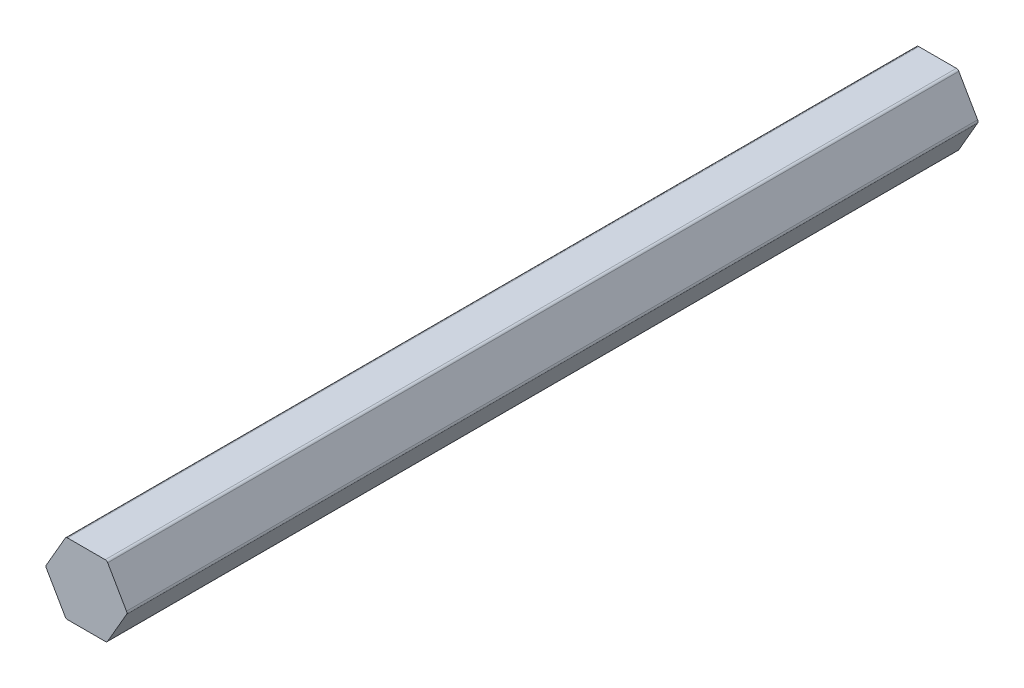
ISO-10303-21;
HEADER;
FILE_DESCRIPTION(('STEP AP214'),'2;1');
FILE_NAME('part.step','',(''),(''),'','','');
FILE_SCHEMA(('AUTOMOTIVE_DESIGN { 1 0 10303 214 1 1 1 1 }'));
ENDSEC;
DATA;
#1=APPLICATION_CONTEXT('core data for automotive mechanical design processes');
#2=APPLICATION_PROTOCOL_DEFINITION('international standard','automotive_design',2000,#1);
#3=PRODUCT_CONTEXT('',#1,'mechanical');
#4=PRODUCT('Part','Part','',(#3));
#5=PRODUCT_RELATED_PRODUCT_CATEGORY('part','',(#4));
#6=PRODUCT_DEFINITION_FORMATION('','',#4);
#7=PRODUCT_DEFINITION_CONTEXT('part definition',#1,'design');
#8=PRODUCT_DEFINITION('design','',#6,#7);
#9=PRODUCT_DEFINITION_SHAPE('','',#8);
#10=(LENGTH_UNIT() NAMED_UNIT(*) SI_UNIT(.MILLI.,.METRE.));
#11=(NAMED_UNIT(*) PLANE_ANGLE_UNIT() SI_UNIT($,.RADIAN.));
#12=(NAMED_UNIT(*) SI_UNIT($,.STERADIAN.) SOLID_ANGLE_UNIT());
#13=UNCERTAINTY_MEASURE_WITH_UNIT(LENGTH_MEASURE(1.E-05),#10,'distance_accuracy_value','');
#14=(GEOMETRIC_REPRESENTATION_CONTEXT(3) GLOBAL_UNCERTAINTY_ASSIGNED_CONTEXT((#13)) GLOBAL_UNIT_ASSIGNED_CONTEXT((#10,
#11,#12)) REPRESENTATION_CONTEXT('',''));
#15=CARTESIAN_POINT('',(0.,0.,0.));
#16=DIRECTION('',(0.,0.,1.));
#17=DIRECTION('',(1.,0.,0.));
#18=AXIS2_PLACEMENT_3D('',#15,#16,#17);
#19=CARTESIAN_POINT('',(3.36554792418709,5.8293,457.2));
#20=DIRECTION('',(0.,0.,-1.));
#21=DIRECTION('',(-1.,0.,0.));
#22=AXIS2_PLACEMENT_3D('',#19,#20,#21);
#23=CYLINDRICAL_SURFACE('',#22,0.508);
#24=CARTESIAN_POINT('',(3.36554792418709,5.8293,304.8));
#25=DIRECTION('',(0.,0.,1.));
#26=DIRECTION('',(1.,0.,0.));
#27=AXIS2_PLACEMENT_3D('',#24,#25,#26);
#28=CIRCLE('',#27,0.508);
#29=CARTESIAN_POINT('',(3.36554792418709,6.3373,304.8));
#30=VERTEX_POINT('',#29);
#31=CARTESIAN_POINT('',(3.80548882930958,6.0833,304.8));
#32=VERTEX_POINT('',#31);
#33=EDGE_CURVE('E155',#30,#32,#28,.F.);
#34=ORIENTED_EDGE('',*,*,#33,.F.);
#35=DIRECTION('',(0.,0.,-1.));
#36=VECTOR('',#35,1.);
#37=CARTESIAN_POINT('',(3.36554792418709,6.3373,457.2));
#38=LINE('',#37,#36);
#39=CARTESIAN_POINT('',(3.36554792418709,6.3373,457.2));
#40=VERTEX_POINT('',#39);
#41=EDGE_CURVE('E159',#40,#30,#38,.T.);
#42=ORIENTED_EDGE('',*,*,#41,.F.);
#43=CARTESIAN_POINT('',(3.36554792418709,5.8293,457.2));
#44=DIRECTION('',(0.,0.,1.));
#45=DIRECTION('',(1.,0.,0.));
#46=AXIS2_PLACEMENT_3D('',#43,#44,#45);
#47=CIRCLE('',#46,0.508);
#48=CARTESIAN_POINT('',(3.80548882930957,6.0833,457.2));
#49=VERTEX_POINT('',#48);
#50=EDGE_CURVE('E174',#49,#40,#47,.T.);
#51=ORIENTED_EDGE('',*,*,#50,.F.);
#52=DIRECTION('',(0.,0.,1.));
#53=VECTOR('',#52,1.);
#54=CARTESIAN_POINT('',(3.80548882930958,6.0833,457.2));
#55=LINE('',#54,#53);
#56=EDGE_CURVE('E148',#32,#49,#55,.T.);
#57=ORIENTED_EDGE('',*,*,#56,.F.);
#58=EDGE_LOOP('',(#34,#42,#51,#57));
#59=FACE_BOUND('',#58,.T.);
#60=ADVANCED_FACE('F45',(#59),#23,.T.);
#61=CARTESIAN_POINT('',(-3.36554792418709,5.8293,457.2));
#62=DIRECTION('',(0.,0.,-1.));
#63=DIRECTION('',(-1.,0.,0.));
#64=AXIS2_PLACEMENT_3D('',#61,#62,#63);
#65=CYLINDRICAL_SURFACE('',#64,0.508);
#66=CARTESIAN_POINT('',(-3.36554792418709,5.8293,304.8));
#67=DIRECTION('',(0.,0.,1.));
#68=DIRECTION('',(1.,0.,0.));
#69=AXIS2_PLACEMENT_3D('',#66,#67,#68);
#70=CIRCLE('',#69,0.508);
#71=CARTESIAN_POINT('',(-3.80548882930958,6.0833,304.8));
#72=VERTEX_POINT('',#71);
#73=CARTESIAN_POINT('',(-3.36554792418708,6.3373,304.8));
#74=VERTEX_POINT('',#73);
#75=EDGE_CURVE('E291',#72,#74,#70,.F.);
#76=ORIENTED_EDGE('',*,*,#75,.F.);
#77=DIRECTION('',(0.,0.,-1.));
#78=VECTOR('',#77,1.);
#79=CARTESIAN_POINT('',(-3.80548882930958,6.0833,457.2));
#80=LINE('',#79,#78);
#81=CARTESIAN_POINT('',(-3.80548882930958,6.0833,457.2));
#82=VERTEX_POINT('',#81);
#83=EDGE_CURVE('E173',#82,#72,#80,.T.);
#84=ORIENTED_EDGE('',*,*,#83,.F.);
#85=CARTESIAN_POINT('',(-3.36554792418709,5.8293,457.2));
#86=DIRECTION('',(0.,0.,1.));
#87=DIRECTION('',(1.,0.,0.));
#88=AXIS2_PLACEMENT_3D('',#85,#86,#87);
#89=CIRCLE('',#88,0.508);
#90=CARTESIAN_POINT('',(-3.36554792418708,6.3373,457.2));
#91=VERTEX_POINT('',#90);
#92=EDGE_CURVE('E177',#91,#82,#89,.T.);
#93=ORIENTED_EDGE('',*,*,#92,.F.);
#94=DIRECTION('',(0.,0.,1.));
#95=VECTOR('',#94,1.);
#96=CARTESIAN_POINT('',(-3.36554792418709,6.3373,457.2));
#97=LINE('',#96,#95);
#98=EDGE_CURVE('E151',#74,#91,#97,.T.);
#99=ORIENTED_EDGE('',*,*,#98,.F.);
#100=EDGE_LOOP('',(#76,#84,#93,#99));
#101=FACE_BOUND('',#100,.T.);
#102=ADVANCED_FACE('F308',(#101),#65,.T.);
#103=CARTESIAN_POINT('',(6.73109584837417,0.,457.2));
#104=DIRECTION('',(0.,0.,-1.));
#105=DIRECTION('',(-1.,0.,0.));
#106=AXIS2_PLACEMENT_3D('',#103,#104,#105);
#107=CYLINDRICAL_SURFACE('',#106,0.508);
#108=CARTESIAN_POINT('',(6.73109584837417,0.,304.8));
#109=DIRECTION('',(0.,0.,1.));
#110=DIRECTION('',(1.,0.,0.));
#111=AXIS2_PLACEMENT_3D('',#108,#109,#110);
#112=CIRCLE('',#111,0.508);
#113=CARTESIAN_POINT('',(7.17103675349666,0.254000000000006,304.8));
#114=VERTEX_POINT('',#113);
#115=CARTESIAN_POINT('',(7.17103675349666,-0.254,304.8));
#116=VERTEX_POINT('',#115);
#117=EDGE_CURVE('E652',#114,#116,#112,.F.);
#118=ORIENTED_EDGE('',*,*,#117,.F.);
#119=DIRECTION('',(0.,0.,-1.));
#120=VECTOR('',#119,1.);
#121=CARTESIAN_POINT('',(7.17103675349666,0.254,457.2));
#122=LINE('',#121,#120);
#123=CARTESIAN_POINT('',(7.17103675349666,0.254000000000004,457.2));
#124=VERTEX_POINT('',#123);
#125=EDGE_CURVE('E147',#124,#114,#122,.T.);
#126=ORIENTED_EDGE('',*,*,#125,.F.);
#127=CARTESIAN_POINT('',(6.73109584837417,0.,457.2));
#128=DIRECTION('',(0.,0.,1.));
#129=DIRECTION('',(1.,0.,0.));
#130=AXIS2_PLACEMENT_3D('',#127,#128,#129);
#131=CIRCLE('',#130,0.508);
#132=CARTESIAN_POINT('',(7.17103675349666,-0.254,457.2));
#133=VERTEX_POINT('',#132);
#134=EDGE_CURVE('E113',#133,#124,#131,.T.);
#135=ORIENTED_EDGE('',*,*,#134,.F.);
#136=DIRECTION('',(0.,0.,1.));
#137=VECTOR('',#136,1.);
#138=CARTESIAN_POINT('',(7.17103675349667,-0.253999999999996,457.2));
#139=LINE('',#138,#137);
#140=EDGE_CURVE('E126',#116,#133,#139,.T.);
#141=ORIENTED_EDGE('',*,*,#140,.F.);
#142=EDGE_LOOP('',(#118,#126,#135,#141));
#143=FACE_BOUND('',#142,.T.);
#144=ADVANCED_FACE('F481',(#143),#107,.T.);
#145=CARTESIAN_POINT('',(3.36554792418709,-5.8293,457.2));
#146=DIRECTION('',(0.,0.,-1.));
#147=DIRECTION('',(-1.,0.,0.));
#148=AXIS2_PLACEMENT_3D('',#145,#146,#147);
#149=CYLINDRICAL_SURFACE('',#148,0.508);
#150=CARTESIAN_POINT('',(3.36554792418709,-5.8293,304.8));
#151=DIRECTION('',(0.,0.,1.));
#152=DIRECTION('',(1.,0.,0.));
#153=AXIS2_PLACEMENT_3D('',#150,#151,#152);
#154=CIRCLE('',#153,0.508);
#155=CARTESIAN_POINT('',(3.80548882930958,-6.0833,304.8));
#156=VERTEX_POINT('',#155);
#157=CARTESIAN_POINT('',(3.36554792418709,-6.3373,304.8));
#158=VERTEX_POINT('',#157);
#159=EDGE_CURVE('E122',#156,#158,#154,.F.);
#160=ORIENTED_EDGE('',*,*,#159,.F.);
#161=DIRECTION('',(0.,0.,-1.));
#162=VECTOR('',#161,1.);
#163=CARTESIAN_POINT('',(3.80548882930958,-6.0833,457.2));
#164=LINE('',#163,#162);
#165=CARTESIAN_POINT('',(3.80548882930958,-6.0833,457.2));
#166=VERTEX_POINT('',#165);
#167=EDGE_CURVE('E118',#166,#156,#164,.T.);
#168=ORIENTED_EDGE('',*,*,#167,.F.);
#169=CARTESIAN_POINT('',(3.36554792418709,-5.8293,457.2));
#170=DIRECTION('',(0.,0.,1.));
#171=DIRECTION('',(1.,0.,0.));
#172=AXIS2_PLACEMENT_3D('',#169,#170,#171);
#173=CIRCLE('',#172,0.508);
#174=CARTESIAN_POINT('',(3.36554792418709,-6.3373,457.2));
#175=VERTEX_POINT('',#174);
#176=EDGE_CURVE('E105',#175,#166,#173,.T.);
#177=ORIENTED_EDGE('',*,*,#176,.F.);
#178=DIRECTION('',(0.,0.,1.));
#179=VECTOR('',#178,1.);
#180=CARTESIAN_POINT('',(3.36554792418709,-6.3373,457.2));
#181=LINE('',#180,#179);
#182=EDGE_CURVE('E73',#158,#175,#181,.T.);
#183=ORIENTED_EDGE('',*,*,#182,.F.);
#184=EDGE_LOOP('',(#160,#168,#177,#183));
#185=FACE_BOUND('',#184,.T.);
#186=ADVANCED_FACE('F119',(#185),#149,.T.);
#187=CARTESIAN_POINT('',(-6.73109584837417,0.,457.2));
#188=DIRECTION('',(0.,0.,-1.));
#189=DIRECTION('',(-1.,0.,0.));
#190=AXIS2_PLACEMENT_3D('',#187,#188,#189);
#191=CYLINDRICAL_SURFACE('',#190,0.508);
#192=CARTESIAN_POINT('',(-6.73109584837417,0.,304.8));
#193=DIRECTION('',(0.,0.,1.));
#194=DIRECTION('',(1.,0.,0.));
#195=AXIS2_PLACEMENT_3D('',#192,#193,#194);
#196=CIRCLE('',#195,0.508);
#197=CARTESIAN_POINT('',(-7.23909584837417,0.,304.8));
#198=VERTEX_POINT('',#197);
#199=CARTESIAN_POINT('',(-7.17103675349666,0.253999999999999,304.8));
#200=VERTEX_POINT('',#199);
#201=EDGE_CURVE('E240',#198,#200,#196,.F.);
#202=ORIENTED_EDGE('',*,*,#201,.F.);
#203=DIRECTION('',(0.,0.,-1.));
#204=VECTOR('',#203,1.);
#205=CARTESIAN_POINT('',(-7.23909584837417,0.,457.2));
#206=LINE('',#205,#204);
#207=CARTESIAN_POINT('',(-7.23909584837417,0.,457.2));
#208=VERTEX_POINT('',#207);
#209=EDGE_CURVE('E138',#208,#198,#206,.T.);
#210=ORIENTED_EDGE('',*,*,#209,.F.);
#211=CARTESIAN_POINT('',(-6.73109584837417,0.,457.2));
#212=DIRECTION('',(0.,0.,1.));
#213=DIRECTION('',(1.,0.,0.));
#214=AXIS2_PLACEMENT_3D('',#211,#212,#213);
#215=CIRCLE('',#214,0.508);
#216=CARTESIAN_POINT('',(-7.17103675349666,0.253999999999997,457.2));
#217=VERTEX_POINT('',#216);
#218=EDGE_CURVE('E53',#217,#208,#215,.T.);
#219=ORIENTED_EDGE('',*,*,#218,.F.);
#220=DIRECTION('',(0.,0.,1.));
#221=VECTOR('',#220,1.);
#222=CARTESIAN_POINT('',(-7.17103675349666,0.253999999999995,457.2));
#223=LINE('',#222,#221);
#224=EDGE_CURVE('E163',#200,#217,#223,.T.);
#225=ORIENTED_EDGE('',*,*,#224,.F.);
#226=EDGE_LOOP('',(#202,#210,#219,#225));
#227=FACE_BOUND('',#226,.T.);
#228=ADVANCED_FACE('F237',(#227),#191,.T.);
#229=CARTESIAN_POINT('',(-3.36554792418708,-5.8293,457.2));
#230=DIRECTION('',(0.,0.,-1.));
#231=DIRECTION('',(-1.,0.,0.));
#232=AXIS2_PLACEMENT_3D('',#229,#230,#231);
#233=CYLINDRICAL_SURFACE('',#232,0.508);
#234=CARTESIAN_POINT('',(-3.36554792418708,-5.8293,304.8));
#235=DIRECTION('',(0.,0.,1.));
#236=DIRECTION('',(1.,0.,0.));
#237=AXIS2_PLACEMENT_3D('',#234,#235,#236);
#238=CIRCLE('',#237,0.508);
#239=CARTESIAN_POINT('',(-3.36554792418708,-6.3373,304.8));
#240=VERTEX_POINT('',#239);
#241=CARTESIAN_POINT('',(-3.80548882930958,-6.0833,304.8));
#242=VERTEX_POINT('',#241);
#243=EDGE_CURVE('E667',#240,#242,#238,.F.);
#244=ORIENTED_EDGE('',*,*,#243,.F.);
#245=DIRECTION('',(0.,0.,-1.));
#246=VECTOR('',#245,1.);
#247=CARTESIAN_POINT('',(-3.36554792418708,-6.3373,457.2));
#248=LINE('',#247,#246);
#249=CARTESIAN_POINT('',(-3.36554792418708,-6.3373,457.2));
#250=VERTEX_POINT('',#249);
#251=EDGE_CURVE('E202',#250,#240,#248,.T.);
#252=ORIENTED_EDGE('',*,*,#251,.F.);
#253=CARTESIAN_POINT('',(-3.36554792418708,-5.8293,457.2));
#254=DIRECTION('',(0.,0.,1.));
#255=DIRECTION('',(1.,0.,0.));
#256=AXIS2_PLACEMENT_3D('',#253,#254,#255);
#257=CIRCLE('',#256,0.508);
#258=CARTESIAN_POINT('',(-3.80548882930957,-6.0833,457.2));
#259=VERTEX_POINT('',#258);
#260=EDGE_CURVE('E114',#259,#250,#257,.T.);
#261=ORIENTED_EDGE('',*,*,#260,.F.);
#262=DIRECTION('',(0.,0.,1.));
#263=VECTOR('',#262,1.);
#264=CARTESIAN_POINT('',(-3.80548882930957,-6.0833,457.2));
#265=LINE('',#264,#263);
#266=EDGE_CURVE('E167',#242,#259,#265,.T.);
#267=ORIENTED_EDGE('',*,*,#266,.F.);
#268=EDGE_LOOP('',(#244,#252,#261,#267));
#269=FACE_BOUND('',#268,.T.);
#270=ADVANCED_FACE('F437',(#269),#233,.T.);
#271=CARTESIAN_POINT('',(7.31768372187083,0.,457.2));
#272=DIRECTION('',(0.,0.,1.));
#273=DIRECTION('',(1.,0.,0.));
#274=AXIS2_PLACEMENT_3D('',#271,#272,#273);
#275=PLANE('',#274);
#276=DIRECTION('',(0.5,-0.866025403784439,0.));
#277=VECTOR('',#276,1.);
#278=CARTESIAN_POINT('',(-7.31768372187083,0.,457.2));
#279=LINE('',#278,#277);
#280=CARTESIAN_POINT('',(-7.17103675349666,-0.254000000000004,457.2));
#281=VERTEX_POINT('',#280);
#282=EDGE_CURVE('E164',#281,#259,#279,.T.);
#283=ORIENTED_EDGE('',*,*,#282,.T.);
#284=ORIENTED_EDGE('',*,*,#260,.T.);
#285=DIRECTION('',(1.,0.,0.));
#286=VECTOR('',#285,1.);
#287=CARTESIAN_POINT('',(-3.6588418609354,-6.3373,457.2));
#288=LINE('',#287,#286);
#289=EDGE_CURVE('E110',#250,#175,#288,.T.);
#290=ORIENTED_EDGE('',*,*,#289,.T.);
#291=ORIENTED_EDGE('',*,*,#176,.T.);
#292=DIRECTION('',(0.5,0.866025403784439,0.));
#293=VECTOR('',#292,1.);
#294=CARTESIAN_POINT('',(3.65884186093541,-6.3373,457.2));
#295=LINE('',#294,#293);
#296=EDGE_CURVE('E109',#166,#133,#295,.T.);
#297=ORIENTED_EDGE('',*,*,#296,.T.);
#298=ORIENTED_EDGE('',*,*,#134,.T.);
#299=DIRECTION('',(-0.5,0.866025403784439,0.));
#300=VECTOR('',#299,1.);
#301=CARTESIAN_POINT('',(7.31768372187083,0.,457.2));
#302=LINE('',#301,#300);
#303=EDGE_CURVE('E143',#124,#49,#302,.T.);
#304=ORIENTED_EDGE('',*,*,#303,.T.);
#305=ORIENTED_EDGE('',*,*,#50,.T.);
#306=DIRECTION('',(-1.,0.,0.));
#307=VECTOR('',#306,1.);
#308=CARTESIAN_POINT('',(3.65884186093541,6.3373,457.2));
#309=LINE('',#308,#307);
#310=EDGE_CURVE('E142',#40,#91,#309,.T.);
#311=ORIENTED_EDGE('',*,*,#310,.T.);
#312=ORIENTED_EDGE('',*,*,#92,.T.);
#313=DIRECTION('',(-0.5,-0.866025403784439,0.));
#314=VECTOR('',#313,1.);
#315=CARTESIAN_POINT('',(-3.65884186093541,6.3373,457.2));
#316=LINE('',#315,#314);
#317=EDGE_CURVE('E198',#82,#217,#316,.T.);
#318=ORIENTED_EDGE('',*,*,#317,.T.);
#319=ORIENTED_EDGE('',*,*,#218,.T.);
#320=CARTESIAN_POINT('',(-6.73109584837417,0.,457.2));
#321=DIRECTION('',(0.,0.,1.));
#322=DIRECTION('',(1.,0.,0.));
#323=AXIS2_PLACEMENT_3D('',#320,#321,#322);
#324=CIRCLE('',#323,0.508);
#325=EDGE_CURVE('E152',#208,#281,#324,.T.);
#326=ORIENTED_EDGE('',*,*,#325,.T.);
#327=EDGE_LOOP('',(#283,#284,#290,#291,#297,#298,#304,#305,#311,#312,#318,#319,#326));
#328=FACE_BOUND('',#327,.T.);
#329=ADVANCED_FACE('F47',(#328),#275,.T.);
#330=CARTESIAN_POINT('',(-3.6588418609354,-6.3373,457.2));
#331=DIRECTION('',(0.,1.,0.));
#332=DIRECTION('',(1.,0.,0.));
#333=AXIS2_PLACEMENT_3D('',#330,#331,#332);
#334=PLANE('',#333);
#335=ORIENTED_EDGE('',*,*,#251,.T.);
#336=DIRECTION('',(1.,0.,0.));
#337=VECTOR('',#336,1.);
#338=CARTESIAN_POINT('',(-3.6588418609354,-6.3373,304.8));
#339=LINE('',#338,#337);
#340=EDGE_CURVE('E663',#240,#158,#339,.T.);
#341=ORIENTED_EDGE('',*,*,#340,.T.);
#342=ORIENTED_EDGE('',*,*,#182,.T.);
#343=ORIENTED_EDGE('',*,*,#289,.F.);
#344=EDGE_LOOP('',(#335,#341,#342,#343));
#345=FACE_BOUND('',#344,.T.);
#346=ADVANCED_FACE('F414',(#345),#334,.F.);
#347=CARTESIAN_POINT('',(-7.31768372187083,0.,457.2));
#348=DIRECTION('',(0.866025403784438,0.5,0.));
#349=DIRECTION('',(0.,0.,-1.));
#350=AXIS2_PLACEMENT_3D('',#347,#348,#349);
#351=PLANE('',#350);
#352=DIRECTION('',(0.,0.,-1.));
#353=VECTOR('',#352,1.);
#354=CARTESIAN_POINT('',(-7.17103675349666,-0.254000000000004,457.2));
#355=LINE('',#354,#353);
#356=CARTESIAN_POINT('',(-7.17103675349666,-0.254000000000004,304.8));
#357=VERTEX_POINT('',#356);
#358=EDGE_CURVE('E132',#281,#357,#355,.T.);
#359=ORIENTED_EDGE('',*,*,#358,.T.);
#360=DIRECTION('',(0.5,-0.866025403784438,0.));
#361=VECTOR('',#360,1.);
#362=CARTESIAN_POINT('',(-7.31768372187083,0.,304.8));
#363=LINE('',#362,#361);
#364=EDGE_CURVE('E59',#357,#242,#363,.T.);
#365=ORIENTED_EDGE('',*,*,#364,.T.);
#366=ORIENTED_EDGE('',*,*,#266,.T.);
#367=ORIENTED_EDGE('',*,*,#282,.F.);
#368=EDGE_LOOP('',(#359,#365,#366,#367));
#369=FACE_BOUND('',#368,.T.);
#370=ADVANCED_FACE('F246',(#369),#351,.F.);
#371=CARTESIAN_POINT('',(-3.65884186093541,6.3373,457.2));
#372=DIRECTION('',(0.866025403784439,-0.5,0.));
#373=DIRECTION('',(0.,0.,-1.));
#374=AXIS2_PLACEMENT_3D('',#371,#372,#373);
#375=PLANE('',#374);
#376=ORIENTED_EDGE('',*,*,#83,.T.);
#377=DIRECTION('',(-0.5,-0.866025403784439,0.));
#378=VECTOR('',#377,1.);
#379=CARTESIAN_POINT('',(-3.65884186093541,6.3373,304.8));
#380=LINE('',#379,#378);
#381=EDGE_CURVE('E297',#72,#200,#380,.T.);
#382=ORIENTED_EDGE('',*,*,#381,.T.);
#383=ORIENTED_EDGE('',*,*,#224,.T.);
#384=ORIENTED_EDGE('',*,*,#317,.F.);
#385=EDGE_LOOP('',(#376,#382,#383,#384));
#386=FACE_BOUND('',#385,.T.);
#387=ADVANCED_FACE('F407',(#386),#375,.F.);
#388=CARTESIAN_POINT('',(3.65884186093541,6.3373,457.2));
#389=DIRECTION('',(0.,-1.,0.));
#390=DIRECTION('',(0.,0.,-1.));
#391=AXIS2_PLACEMENT_3D('',#388,#389,#390);
#392=PLANE('',#391);
#393=ORIENTED_EDGE('',*,*,#41,.T.);
#394=DIRECTION('',(1.,0.,0.));
#395=VECTOR('',#394,1.);
#396=CARTESIAN_POINT('',(0.,6.3373,304.8));
#397=LINE('',#396,#395);
#398=EDGE_CURVE('E294',#74,#30,#397,.T.);
#399=ORIENTED_EDGE('',*,*,#398,.F.);
#400=ORIENTED_EDGE('',*,*,#98,.T.);
#401=ORIENTED_EDGE('',*,*,#310,.F.);
#402=EDGE_LOOP('',(#393,#399,#400,#401));
#403=FACE_BOUND('',#402,.T.);
#404=ADVANCED_FACE('F304',(#403),#392,.F.);
#405=CARTESIAN_POINT('',(7.31768372187083,0.,457.2));
#406=DIRECTION('',(-0.866025403784439,-0.5,0.));
#407=DIRECTION('',(-0.5,0.866025403784439,0.));
#408=AXIS2_PLACEMENT_3D('',#405,#406,#407);
#409=PLANE('',#408);
#410=ORIENTED_EDGE('',*,*,#125,.T.);
#411=DIRECTION('',(-0.5,0.866025403784439,0.));
#412=VECTOR('',#411,1.);
#413=CARTESIAN_POINT('',(7.31768372187083,0.,304.8));
#414=LINE('',#413,#412);
#415=EDGE_CURVE('E654',#114,#32,#414,.T.);
#416=ORIENTED_EDGE('',*,*,#415,.T.);
#417=ORIENTED_EDGE('',*,*,#56,.T.);
#418=ORIENTED_EDGE('',*,*,#303,.F.);
#419=EDGE_LOOP('',(#410,#416,#417,#418));
#420=FACE_BOUND('',#419,.T.);
#421=ADVANCED_FACE('F390',(#420),#409,.F.);
#422=CARTESIAN_POINT('',(3.65884186093541,-6.3373,457.2));
#423=DIRECTION('',(-0.866025403784439,0.5,0.));
#424=DIRECTION('',(0.,0.,1.));
#425=AXIS2_PLACEMENT_3D('',#422,#423,#424);
#426=PLANE('',#425);
#427=ORIENTED_EDGE('',*,*,#167,.T.);
#428=DIRECTION('',(0.5,0.866025403784439,0.));
#429=VECTOR('',#428,1.);
#430=CARTESIAN_POINT('',(3.65884186093541,-6.3373,304.8));
#431=LINE('',#430,#429);
#432=EDGE_CURVE('E301',#156,#116,#431,.T.);
#433=ORIENTED_EDGE('',*,*,#432,.T.);
#434=ORIENTED_EDGE('',*,*,#140,.T.);
#435=ORIENTED_EDGE('',*,*,#296,.F.);
#436=EDGE_LOOP('',(#427,#433,#434,#435));
#437=FACE_BOUND('',#436,.T.);
#438=ADVANCED_FACE('F128',(#437),#426,.F.);
#439=CARTESIAN_POINT('',(-6.73109584837417,0.,457.2));
#440=DIRECTION('',(0.,0.,-1.));
#441=DIRECTION('',(-1.,0.,0.));
#442=AXIS2_PLACEMENT_3D('',#439,#440,#441);
#443=CYLINDRICAL_SURFACE('',#442,0.508);
#444=CARTESIAN_POINT('',(-6.73109584837417,0.,304.8));
#445=DIRECTION('',(0.,0.,1.));
#446=DIRECTION('',(1.,0.,0.));
#447=AXIS2_PLACEMENT_3D('',#444,#445,#446);
#448=CIRCLE('',#447,0.508);
#449=EDGE_CURVE('E11',#357,#198,#448,.F.);
#450=ORIENTED_EDGE('',*,*,#449,.F.);
#451=ORIENTED_EDGE('',*,*,#358,.F.);
#452=ORIENTED_EDGE('',*,*,#325,.F.);
#453=ORIENTED_EDGE('',*,*,#209,.T.);
#454=EDGE_LOOP('',(#450,#451,#452,#453));
#455=FACE_BOUND('',#454,.T.);
#456=ADVANCED_FACE('F244',(#455),#443,.T.);
#457=CARTESIAN_POINT('',(0.,-128.7907,304.8));
#458=DIRECTION('',(0.,0.,1.));
#459=DIRECTION('',(1.,0.,0.));
#460=AXIS2_PLACEMENT_3D('',#457,#458,#459);
#461=PLANE('',#460);
#462=ORIENTED_EDGE('',*,*,#33,.T.);
#463=ORIENTED_EDGE('',*,*,#415,.F.);
#464=ORIENTED_EDGE('',*,*,#117,.T.);
#465=ORIENTED_EDGE('',*,*,#432,.F.);
#466=ORIENTED_EDGE('',*,*,#159,.T.);
#467=ORIENTED_EDGE('',*,*,#340,.F.);
#468=ORIENTED_EDGE('',*,*,#243,.T.);
#469=ORIENTED_EDGE('',*,*,#364,.F.);
#470=ORIENTED_EDGE('',*,*,#449,.T.);
#471=ORIENTED_EDGE('',*,*,#201,.T.);
#472=ORIENTED_EDGE('',*,*,#381,.F.);
#473=ORIENTED_EDGE('',*,*,#75,.T.);
#474=ORIENTED_EDGE('',*,*,#398,.T.);
#475=EDGE_LOOP('',(#462,#463,#464,#465,#466,#467,#468,#469,#470,#471,#472,#473,#474));
#476=FACE_BOUND('',#475,.T.);
#477=ADVANCED_FACE('F293',(#476),#461,.F.);
#478=CLOSED_SHELL('',(#60,#102,#144,#186,#228,#270,#329,#346,#370,#387,#404,#421,#438,#456,#477));
#479=MANIFOLD_SOLID_BREP('B2',#478);
#480=ADVANCED_BREP_SHAPE_REPRESENTATION('',(#18,#479),#14);
#481=SHAPE_DEFINITION_REPRESENTATION(#9,#480);
ENDSEC;
END-ISO-10303-21;
